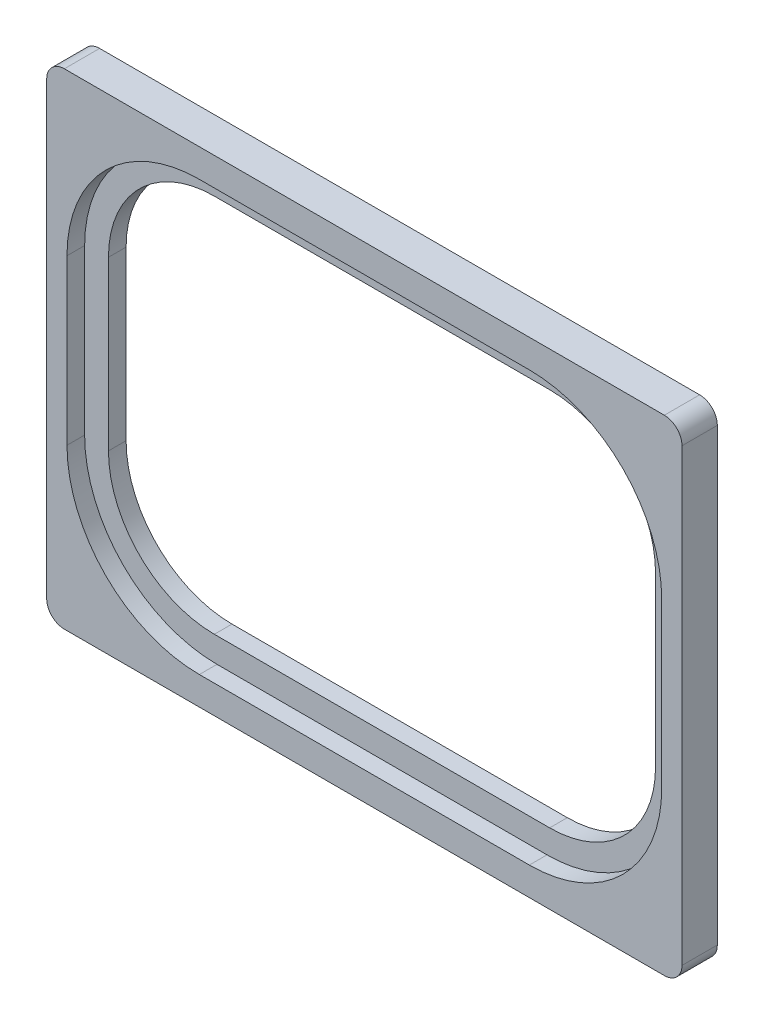
ISO-10303-21;
HEADER;
FILE_DESCRIPTION(('STEP AP214'),'2;1');
FILE_NAME('part.step','',(''),(''),'','','');
FILE_SCHEMA(('AUTOMOTIVE_DESIGN { 1 0 10303 214 1 1 1 1 }'));
ENDSEC;
DATA;
#1=APPLICATION_CONTEXT('core data for automotive mechanical design processes');
#2=APPLICATION_PROTOCOL_DEFINITION('international standard','automotive_design',2000,#1);
#3=PRODUCT_CONTEXT('',#1,'mechanical');
#4=PRODUCT('Part','Part','',(#3));
#5=PRODUCT_RELATED_PRODUCT_CATEGORY('part','',(#4));
#6=PRODUCT_DEFINITION_FORMATION('','',#4);
#7=PRODUCT_DEFINITION_CONTEXT('part definition',#1,'design');
#8=PRODUCT_DEFINITION('design','',#6,#7);
#9=PRODUCT_DEFINITION_SHAPE('','',#8);
#10=(LENGTH_UNIT() NAMED_UNIT(*) SI_UNIT(.MILLI.,.METRE.));
#11=(NAMED_UNIT(*) PLANE_ANGLE_UNIT() SI_UNIT($,.RADIAN.));
#12=(NAMED_UNIT(*) SI_UNIT($,.STERADIAN.) SOLID_ANGLE_UNIT());
#13=UNCERTAINTY_MEASURE_WITH_UNIT(LENGTH_MEASURE(1.E-05),#10,'distance_accuracy_value','');
#14=(GEOMETRIC_REPRESENTATION_CONTEXT(3) GLOBAL_UNCERTAINTY_ASSIGNED_CONTEXT((#13)) GLOBAL_UNIT_ASSIGNED_CONTEXT((#10,
#11,#12)) REPRESENTATION_CONTEXT('',''));
#15=CARTESIAN_POINT('',(0.,0.,0.));
#16=DIRECTION('',(0.,0.,1.));
#17=DIRECTION('',(1.,0.,0.));
#18=AXIS2_PLACEMENT_3D('',#15,#16,#17);
#19=CARTESIAN_POINT('',(19.,9.50000000000001,-0.00100000000000013));
#20=DIRECTION('',(0.,0.,1.));
#21=DIRECTION('',(1.,0.,0.));
#22=AXIS2_PLACEMENT_3D('',#19,#20,#21);
#23=CYLINDRICAL_SURFACE('',#22,12.);
#24=CARTESIAN_POINT('',(19.,9.50000000000001,2.));
#25=DIRECTION('',(0.,0.,1.));
#26=DIRECTION('',(1.,0.,0.));
#27=AXIS2_PLACEMENT_3D('',#24,#25,#26);
#28=CIRCLE('',#27,12.);
#29=CARTESIAN_POINT('',(18.9999999999999,21.5,2.));
#30=VERTEX_POINT('',#29);
#31=CARTESIAN_POINT('',(31.,9.49999999999992,2.));
#32=VERTEX_POINT('',#31);
#33=EDGE_CURVE('E279',#30,#32,#28,.F.);
#34=ORIENTED_EDGE('',*,*,#33,.F.);
#35=DIRECTION('',(0.,0.,1.));
#36=VECTOR('',#35,1.);
#37=CARTESIAN_POINT('',(18.9999999999999,21.5,-0.00100000000000013));
#38=LINE('',#37,#36);
#39=CARTESIAN_POINT('',(18.9999999999999,21.5,0.));
#40=VERTEX_POINT('',#39);
#41=EDGE_CURVE('E302',#40,#30,#38,.T.);
#42=ORIENTED_EDGE('',*,*,#41,.F.);
#43=CARTESIAN_POINT('',(19.,9.50000000000001,0.));
#44=DIRECTION('',(0.,0.,-1.));
#45=DIRECTION('',(-1.,0.,0.));
#46=AXIS2_PLACEMENT_3D('',#43,#44,#45);
#47=CIRCLE('',#46,12.);
#48=CARTESIAN_POINT('',(31.,9.49999999999992,0.));
#49=VERTEX_POINT('',#48);
#50=EDGE_CURVE('E299',#49,#40,#47,.F.);
#51=ORIENTED_EDGE('',*,*,#50,.F.);
#52=DIRECTION('',(0.,0.,1.));
#53=VECTOR('',#52,1.);
#54=CARTESIAN_POINT('',(31.,9.49999999999992,-0.00100000000000013));
#55=LINE('',#54,#53);
#56=EDGE_CURVE('E303',#49,#32,#55,.T.);
#57=ORIENTED_EDGE('',*,*,#56,.T.);
#58=EDGE_LOOP('',(#34,#42,#51,#57));
#59=FACE_BOUND('',#58,.T.);
#60=ADVANCED_FACE('F38',(#59),#23,.F.);
#61=CARTESIAN_POINT('',(31.,-9.4999999999999,-0.00100000000000013));
#62=DIRECTION('',(1.,0.,0.));
#63=DIRECTION('',(0.,1.,0.));
#64=AXIS2_PLACEMENT_3D('',#61,#62,#63);
#65=PLANE('',#64);
#66=DIRECTION('',(0.,-1.,0.));
#67=VECTOR('',#66,1.);
#68=CARTESIAN_POINT('',(31.,-9.4999999999999,2.));
#69=LINE('',#68,#67);
#70=CARTESIAN_POINT('',(31.,-9.49999999999999,2.));
#71=VERTEX_POINT('',#70);
#72=EDGE_CURVE('E277',#32,#71,#69,.T.);
#73=ORIENTED_EDGE('',*,*,#72,.F.);
#74=ORIENTED_EDGE('',*,*,#56,.F.);
#75=DIRECTION('',(0.,1.,0.));
#76=VECTOR('',#75,1.);
#77=CARTESIAN_POINT('',(31.,-9.4999999999999,0.));
#78=LINE('',#77,#76);
#79=CARTESIAN_POINT('',(31.,-9.4999999999999,0.));
#80=VERTEX_POINT('',#79);
#81=EDGE_CURVE('E296',#80,#49,#78,.T.);
#82=ORIENTED_EDGE('',*,*,#81,.F.);
#83=DIRECTION('',(0.,0.,1.));
#84=VECTOR('',#83,1.);
#85=CARTESIAN_POINT('',(31.,-9.4999999999999,-0.00100000000000013));
#86=LINE('',#85,#84);
#87=EDGE_CURVE('E307',#80,#71,#86,.T.);
#88=ORIENTED_EDGE('',*,*,#87,.T.);
#89=EDGE_LOOP('',(#73,#74,#82,#88));
#90=FACE_BOUND('',#89,.T.);
#91=ADVANCED_FACE('F432',(#90),#65,.F.);
#92=CARTESIAN_POINT('',(19.,-9.49999999999999,-0.00100000000000013));
#93=DIRECTION('',(0.,0.,1.));
#94=DIRECTION('',(1.,0.,0.));
#95=AXIS2_PLACEMENT_3D('',#92,#93,#94);
#96=CYLINDRICAL_SURFACE('',#95,12.);
#97=CARTESIAN_POINT('',(19.,-9.49999999999999,2.));
#98=DIRECTION('',(0.,0.,1.));
#99=DIRECTION('',(1.,0.,0.));
#100=AXIS2_PLACEMENT_3D('',#97,#98,#99);
#101=CIRCLE('',#100,12.);
#102=CARTESIAN_POINT('',(18.9999999999999,-21.5,2.));
#103=VERTEX_POINT('',#102);
#104=EDGE_CURVE('E275',#71,#103,#101,.F.);
#105=ORIENTED_EDGE('',*,*,#104,.F.);
#106=ORIENTED_EDGE('',*,*,#87,.F.);
#107=CARTESIAN_POINT('',(19.,-9.49999999999999,0.));
#108=DIRECTION('',(0.,0.,-1.));
#109=DIRECTION('',(-1.,0.,0.));
#110=AXIS2_PLACEMENT_3D('',#107,#108,#109);
#111=CIRCLE('',#110,12.);
#112=CARTESIAN_POINT('',(18.9999999999999,-21.5,0.));
#113=VERTEX_POINT('',#112);
#114=EDGE_CURVE('E293',#113,#80,#111,.F.);
#115=ORIENTED_EDGE('',*,*,#114,.F.);
#116=DIRECTION('',(0.,0.,1.));
#117=VECTOR('',#116,1.);
#118=CARTESIAN_POINT('',(18.9999999999999,-21.5,-0.00100000000000013));
#119=LINE('',#118,#117);
#120=EDGE_CURVE('E310',#113,#103,#119,.T.);
#121=ORIENTED_EDGE('',*,*,#120,.T.);
#122=EDGE_LOOP('',(#105,#106,#115,#121));
#123=FACE_BOUND('',#122,.T.);
#124=ADVANCED_FACE('F438',(#123),#96,.F.);
#125=CARTESIAN_POINT('',(-18.9999999999999,-21.5,-0.00100000000000013));
#126=DIRECTION('',(0.,-1.,0.));
#127=DIRECTION('',(1.,0.,0.));
#128=AXIS2_PLACEMENT_3D('',#125,#126,#127);
#129=PLANE('',#128);
#130=DIRECTION('',(-1.,0.,0.));
#131=VECTOR('',#130,1.);
#132=CARTESIAN_POINT('',(-18.9999999999999,-21.5,2.));
#133=LINE('',#132,#131);
#134=CARTESIAN_POINT('',(-18.9999999999999,-21.5,2.));
#135=VERTEX_POINT('',#134);
#136=EDGE_CURVE('E273',#103,#135,#133,.T.);
#137=ORIENTED_EDGE('',*,*,#136,.F.);
#138=ORIENTED_EDGE('',*,*,#120,.F.);
#139=DIRECTION('',(1.,0.,0.));
#140=VECTOR('',#139,1.);
#141=CARTESIAN_POINT('',(-18.9999999999999,-21.5,0.));
#142=LINE('',#141,#140);
#143=CARTESIAN_POINT('',(-18.9999999999999,-21.5,0.));
#144=VERTEX_POINT('',#143);
#145=EDGE_CURVE('E290',#144,#113,#142,.T.);
#146=ORIENTED_EDGE('',*,*,#145,.F.);
#147=DIRECTION('',(0.,0.,1.));
#148=VECTOR('',#147,1.);
#149=CARTESIAN_POINT('',(-18.9999999999999,-21.5,-0.00100000000000013));
#150=LINE('',#149,#148);
#151=EDGE_CURVE('E313',#144,#135,#150,.T.);
#152=ORIENTED_EDGE('',*,*,#151,.T.);
#153=EDGE_LOOP('',(#137,#138,#146,#152));
#154=FACE_BOUND('',#153,.T.);
#155=ADVANCED_FACE('F511',(#154),#129,.F.);
#156=CARTESIAN_POINT('',(-19.,-9.49999999999999,-0.00100000000000013));
#157=DIRECTION('',(0.,0.,1.));
#158=DIRECTION('',(1.,0.,0.));
#159=AXIS2_PLACEMENT_3D('',#156,#157,#158);
#160=CYLINDRICAL_SURFACE('',#159,12.);
#161=CARTESIAN_POINT('',(-19.,-9.49999999999999,2.));
#162=DIRECTION('',(0.,0.,1.));
#163=DIRECTION('',(1.,0.,0.));
#164=AXIS2_PLACEMENT_3D('',#161,#162,#163);
#165=CIRCLE('',#164,12.);
#166=CARTESIAN_POINT('',(-31.,-9.4999999999999,2.));
#167=VERTEX_POINT('',#166);
#168=EDGE_CURVE('E271',#135,#167,#165,.F.);
#169=ORIENTED_EDGE('',*,*,#168,.F.);
#170=ORIENTED_EDGE('',*,*,#151,.F.);
#171=CARTESIAN_POINT('',(-19.,-9.49999999999999,0.));
#172=DIRECTION('',(0.,0.,-1.));
#173=DIRECTION('',(-1.,0.,0.));
#174=AXIS2_PLACEMENT_3D('',#171,#172,#173);
#175=CIRCLE('',#174,12.);
#176=CARTESIAN_POINT('',(-31.,-9.4999999999999,0.));
#177=VERTEX_POINT('',#176);
#178=EDGE_CURVE('E287',#177,#144,#175,.F.);
#179=ORIENTED_EDGE('',*,*,#178,.F.);
#180=DIRECTION('',(0.,0.,1.));
#181=VECTOR('',#180,1.);
#182=CARTESIAN_POINT('',(-31.,-9.49999999999991,-0.00100000000000013));
#183=LINE('',#182,#181);
#184=EDGE_CURVE('E316',#177,#167,#183,.T.);
#185=ORIENTED_EDGE('',*,*,#184,.T.);
#186=EDGE_LOOP('',(#169,#170,#179,#185));
#187=FACE_BOUND('',#186,.T.);
#188=ADVANCED_FACE('F521',(#187),#160,.F.);
#189=CARTESIAN_POINT('',(-31.,9.49999999999992,-0.00100000000000013));
#190=DIRECTION('',(-1.,0.,0.));
#191=DIRECTION('',(0.,-1.,0.));
#192=AXIS2_PLACEMENT_3D('',#189,#190,#191);
#193=PLANE('',#192);
#194=DIRECTION('',(0.,1.,0.));
#195=VECTOR('',#194,1.);
#196=CARTESIAN_POINT('',(-31.,9.49999999999992,2.));
#197=LINE('',#196,#195);
#198=CARTESIAN_POINT('',(-31.,9.49999999999992,2.));
#199=VERTEX_POINT('',#198);
#200=EDGE_CURVE('E269',#167,#199,#197,.T.);
#201=ORIENTED_EDGE('',*,*,#200,.F.);
#202=ORIENTED_EDGE('',*,*,#184,.F.);
#203=DIRECTION('',(0.,-1.,0.));
#204=VECTOR('',#203,1.);
#205=CARTESIAN_POINT('',(-31.,9.49999999999992,0.));
#206=LINE('',#205,#204);
#207=CARTESIAN_POINT('',(-31.,9.50000000000001,0.));
#208=VERTEX_POINT('',#207);
#209=EDGE_CURVE('E284',#208,#177,#206,.T.);
#210=ORIENTED_EDGE('',*,*,#209,.F.);
#211=DIRECTION('',(0.,0.,1.));
#212=VECTOR('',#211,1.);
#213=CARTESIAN_POINT('',(-31.,9.49999999999992,-0.00100000000000013));
#214=LINE('',#213,#212);
#215=EDGE_CURVE('E319',#208,#199,#214,.T.);
#216=ORIENTED_EDGE('',*,*,#215,.T.);
#217=EDGE_LOOP('',(#201,#202,#210,#216));
#218=FACE_BOUND('',#217,.T.);
#219=ADVANCED_FACE('F531',(#218),#193,.F.);
#220=CARTESIAN_POINT('',(-19.,9.50000000000001,-0.00100000000000013));
#221=DIRECTION('',(0.,0.,1.));
#222=DIRECTION('',(1.,0.,0.));
#223=AXIS2_PLACEMENT_3D('',#220,#221,#222);
#224=CYLINDRICAL_SURFACE('',#223,12.);
#225=CARTESIAN_POINT('',(-19.,9.50000000000001,2.));
#226=DIRECTION('',(0.,0.,1.));
#227=DIRECTION('',(1.,0.,0.));
#228=AXIS2_PLACEMENT_3D('',#225,#226,#227);
#229=CIRCLE('',#228,12.);
#230=CARTESIAN_POINT('',(-18.9999999999999,21.5,2.));
#231=VERTEX_POINT('',#230);
#232=EDGE_CURVE('E60',#199,#231,#229,.F.);
#233=ORIENTED_EDGE('',*,*,#232,.F.);
#234=ORIENTED_EDGE('',*,*,#215,.F.);
#235=CARTESIAN_POINT('',(-19.,9.50000000000001,0.));
#236=DIRECTION('',(0.,0.,-1.));
#237=DIRECTION('',(-1.,0.,0.));
#238=AXIS2_PLACEMENT_3D('',#235,#236,#237);
#239=CIRCLE('',#238,12.);
#240=CARTESIAN_POINT('',(-18.9999999999999,21.5,0.));
#241=VERTEX_POINT('',#240);
#242=EDGE_CURVE('E281',#241,#208,#239,.F.);
#243=ORIENTED_EDGE('',*,*,#242,.F.);
#244=DIRECTION('',(0.,0.,1.));
#245=VECTOR('',#244,1.);
#246=CARTESIAN_POINT('',(-18.9999999999999,21.5,-0.00100000000000013));
#247=LINE('',#246,#245);
#248=EDGE_CURVE('E322',#241,#231,#247,.T.);
#249=ORIENTED_EDGE('',*,*,#248,.T.);
#250=EDGE_LOOP('',(#233,#234,#243,#249));
#251=FACE_BOUND('',#250,.T.);
#252=ADVANCED_FACE('F541',(#251),#224,.F.);
#253=CARTESIAN_POINT('',(18.9999999999999,21.5,-0.00100000000000013));
#254=DIRECTION('',(0.,1.,0.));
#255=DIRECTION('',(-1.,0.,0.));
#256=AXIS2_PLACEMENT_3D('',#253,#254,#255);
#257=PLANE('',#256);
#258=DIRECTION('',(1.,0.,0.));
#259=VECTOR('',#258,1.);
#260=CARTESIAN_POINT('',(18.9999999999999,21.5,2.));
#261=LINE('',#260,#259);
#262=EDGE_CURVE('E11',#231,#30,#261,.T.);
#263=ORIENTED_EDGE('',*,*,#262,.F.);
#264=ORIENTED_EDGE('',*,*,#248,.F.);
#265=DIRECTION('',(-1.,0.,0.));
#266=VECTOR('',#265,1.);
#267=CARTESIAN_POINT('',(18.9999999999999,21.5,0.));
#268=LINE('',#267,#266);
#269=EDGE_CURVE('E306',#40,#241,#268,.T.);
#270=ORIENTED_EDGE('',*,*,#269,.F.);
#271=ORIENTED_EDGE('',*,*,#41,.T.);
#272=EDGE_LOOP('',(#263,#264,#270,#271));
#273=FACE_BOUND('',#272,.T.);
#274=ADVANCED_FACE('F444',(#273),#257,.F.);
#275=CARTESIAN_POINT('',(-36.,27.5,4.));
#276=DIRECTION('',(1.,0.,0.));
#277=DIRECTION('',(0.,1.,0.));
#278=AXIS2_PLACEMENT_3D('',#275,#276,#277);
#279=PLANE('',#278);
#280=DIRECTION('',(0.,-1.,0.));
#281=VECTOR('',#280,1.);
#282=CARTESIAN_POINT('',(-36.,27.5,0.));
#283=LINE('',#282,#281);
#284=CARTESIAN_POINT('',(-36.,25.5,0.));
#285=VERTEX_POINT('',#284);
#286=CARTESIAN_POINT('',(-36.,-25.5,0.));
#287=VERTEX_POINT('',#286);
#288=EDGE_CURVE('E329',#285,#287,#283,.T.);
#289=ORIENTED_EDGE('',*,*,#288,.T.);
#290=DIRECTION('',(0.,0.,-1.));
#291=VECTOR('',#290,1.);
#292=CARTESIAN_POINT('',(-36.,-25.5,4.));
#293=LINE('',#292,#291);
#294=CARTESIAN_POINT('',(-36.,-25.5,4.));
#295=VERTEX_POINT('',#294);
#296=EDGE_CURVE('E369',#287,#295,#293,.F.);
#297=ORIENTED_EDGE('',*,*,#296,.T.);
#298=DIRECTION('',(0.,-1.,0.));
#299=VECTOR('',#298,1.);
#300=CARTESIAN_POINT('',(-36.,27.5,4.));
#301=LINE('',#300,#299);
#302=CARTESIAN_POINT('',(-36.,25.5,4.));
#303=VERTEX_POINT('',#302);
#304=EDGE_CURVE('E330',#303,#295,#301,.T.);
#305=ORIENTED_EDGE('',*,*,#304,.F.);
#306=DIRECTION('',(0.,0.,-1.));
#307=VECTOR('',#306,1.);
#308=CARTESIAN_POINT('',(-36.,25.5,4.));
#309=LINE('',#308,#307);
#310=EDGE_CURVE('E366',#303,#285,#309,.T.);
#311=ORIENTED_EDGE('',*,*,#310,.T.);
#312=EDGE_LOOP('',(#289,#297,#305,#311));
#313=FACE_BOUND('',#312,.T.);
#314=ADVANCED_FACE('F404',(#313),#279,.F.);
#315=CARTESIAN_POINT('',(36.,-27.5,4.));
#316=DIRECTION('',(0.,1.,0.));
#317=DIRECTION('',(-1.,0.,0.));
#318=AXIS2_PLACEMENT_3D('',#315,#316,#317);
#319=PLANE('',#318);
#320=DIRECTION('',(1.,0.,0.));
#321=VECTOR('',#320,1.);
#322=CARTESIAN_POINT('',(36.,-27.5,4.));
#323=LINE('',#322,#321);
#324=CARTESIAN_POINT('',(-34.,-27.5,4.));
#325=VERTEX_POINT('',#324);
#326=CARTESIAN_POINT('',(34.,-27.5,4.));
#327=VERTEX_POINT('',#326);
#328=EDGE_CURVE('E333',#325,#327,#323,.T.);
#329=ORIENTED_EDGE('',*,*,#328,.F.);
#330=DIRECTION('',(0.,0.,-1.));
#331=VECTOR('',#330,1.);
#332=CARTESIAN_POINT('',(-34.,-27.5,4.));
#333=LINE('',#332,#331);
#334=CARTESIAN_POINT('',(-34.,-27.5,0.));
#335=VERTEX_POINT('',#334);
#336=EDGE_CURVE('E355',#325,#335,#333,.T.);
#337=ORIENTED_EDGE('',*,*,#336,.T.);
#338=DIRECTION('',(1.,0.,0.));
#339=VECTOR('',#338,1.);
#340=CARTESIAN_POINT('',(36.,-27.5,0.));
#341=LINE('',#340,#339);
#342=CARTESIAN_POINT('',(34.,-27.5,0.));
#343=VERTEX_POINT('',#342);
#344=EDGE_CURVE('E346',#335,#343,#341,.T.);
#345=ORIENTED_EDGE('',*,*,#344,.T.);
#346=DIRECTION('',(0.,0.,-1.));
#347=VECTOR('',#346,1.);
#348=CARTESIAN_POINT('',(34.,-27.5,4.));
#349=LINE('',#348,#347);
#350=EDGE_CURVE('E343',#343,#327,#349,.F.);
#351=ORIENTED_EDGE('',*,*,#350,.T.);
#352=EDGE_LOOP('',(#329,#337,#345,#351));
#353=FACE_BOUND('',#352,.T.);
#354=ADVANCED_FACE('F414',(#353),#319,.F.);
#355=CARTESIAN_POINT('',(36.,27.5,4.));
#356=DIRECTION('',(-1.,0.,0.));
#357=DIRECTION('',(0.,-1.,0.));
#358=AXIS2_PLACEMENT_3D('',#355,#356,#357);
#359=PLANE('',#358);
#360=DIRECTION('',(0.,1.,0.));
#361=VECTOR('',#360,1.);
#362=CARTESIAN_POINT('',(36.,27.5,4.));
#363=LINE('',#362,#361);
#364=CARTESIAN_POINT('',(36.,-25.5,4.));
#365=VERTEX_POINT('',#364);
#366=CARTESIAN_POINT('',(36.,25.5,4.));
#367=VERTEX_POINT('',#366);
#368=EDGE_CURVE('E337',#365,#367,#363,.T.);
#369=ORIENTED_EDGE('',*,*,#368,.F.);
#370=DIRECTION('',(0.,0.,-1.));
#371=VECTOR('',#370,1.);
#372=CARTESIAN_POINT('',(36.,-25.5,4.));
#373=LINE('',#372,#371);
#374=CARTESIAN_POINT('',(36.,-25.5,0.));
#375=VERTEX_POINT('',#374);
#376=EDGE_CURVE('E381',#365,#375,#373,.T.);
#377=ORIENTED_EDGE('',*,*,#376,.T.);
#378=DIRECTION('',(0.,1.,0.));
#379=VECTOR('',#378,1.);
#380=CARTESIAN_POINT('',(36.,27.5,0.));
#381=LINE('',#380,#379);
#382=CARTESIAN_POINT('',(36.,25.5,0.));
#383=VERTEX_POINT('',#382);
#384=EDGE_CURVE('E349',#375,#383,#381,.T.);
#385=ORIENTED_EDGE('',*,*,#384,.T.);
#386=DIRECTION('',(0.,0.,-1.));
#387=VECTOR('',#386,1.);
#388=CARTESIAN_POINT('',(36.,25.5,4.));
#389=LINE('',#388,#387);
#390=EDGE_CURVE('E379',#383,#367,#389,.F.);
#391=ORIENTED_EDGE('',*,*,#390,.T.);
#392=EDGE_LOOP('',(#369,#377,#385,#391));
#393=FACE_BOUND('',#392,.T.);
#394=ADVANCED_FACE('F422',(#393),#359,.F.);
#395=CARTESIAN_POINT('',(36.,27.5,4.));
#396=DIRECTION('',(0.,-1.,0.));
#397=DIRECTION('',(1.,0.,0.));
#398=AXIS2_PLACEMENT_3D('',#395,#396,#397);
#399=PLANE('',#398);
#400=DIRECTION('',(-1.,0.,0.));
#401=VECTOR('',#400,1.);
#402=CARTESIAN_POINT('',(36.,27.5,4.));
#403=LINE('',#402,#401);
#404=CARTESIAN_POINT('',(34.,27.5,4.));
#405=VERTEX_POINT('',#404);
#406=CARTESIAN_POINT('',(-34.,27.5,4.));
#407=VERTEX_POINT('',#406);
#408=EDGE_CURVE('E340',#405,#407,#403,.T.);
#409=ORIENTED_EDGE('',*,*,#408,.F.);
#410=DIRECTION('',(0.,0.,-1.));
#411=VECTOR('',#410,1.);
#412=CARTESIAN_POINT('',(34.,27.5,4.));
#413=LINE('',#412,#411);
#414=CARTESIAN_POINT('',(34.,27.5,0.));
#415=VERTEX_POINT('',#414);
#416=EDGE_CURVE('E46',#405,#415,#413,.T.);
#417=ORIENTED_EDGE('',*,*,#416,.T.);
#418=DIRECTION('',(-1.,0.,0.));
#419=VECTOR('',#418,1.);
#420=CARTESIAN_POINT('',(36.,27.5,0.));
#421=LINE('',#420,#419);
#422=CARTESIAN_POINT('',(-34.,27.5,0.));
#423=VERTEX_POINT('',#422);
#424=EDGE_CURVE('E334',#415,#423,#421,.T.);
#425=ORIENTED_EDGE('',*,*,#424,.T.);
#426=DIRECTION('',(0.,0.,-1.));
#427=VECTOR('',#426,1.);
#428=CARTESIAN_POINT('',(-34.,27.5,4.));
#429=LINE('',#428,#427);
#430=EDGE_CURVE('E384',#423,#407,#429,.F.);
#431=ORIENTED_EDGE('',*,*,#430,.T.);
#432=EDGE_LOOP('',(#409,#417,#425,#431));
#433=FACE_BOUND('',#432,.T.);
#434=ADVANCED_FACE('F390',(#433),#399,.F.);
#435=CARTESIAN_POINT('',(0.,0.,4.));
#436=DIRECTION('',(0.,0.,-1.));
#437=DIRECTION('',(-1.,0.,0.));
#438=AXIS2_PLACEMENT_3D('',#435,#436,#437);
#439=PLANE('',#438);
#440=DIRECTION('',(-1.,0.,0.));
#441=VECTOR('',#440,1.);
#442=CARTESIAN_POINT('',(18.7,24.3,4.));
#443=LINE('',#442,#441);
#444=CARTESIAN_POINT('',(18.7,24.3,4.));
#445=VERTEX_POINT('',#444);
#446=CARTESIAN_POINT('',(-18.7,24.3,4.));
#447=VERTEX_POINT('',#446);
#448=EDGE_CURVE('E239',#445,#447,#443,.T.);
#449=ORIENTED_EDGE('',*,*,#448,.F.);
#450=CARTESIAN_POINT('',(18.7,9.30000000000001,4.));
#451=DIRECTION('',(0.,0.,1.));
#452=DIRECTION('',(1.,0.,0.));
#453=AXIS2_PLACEMENT_3D('',#450,#451,#452);
#454=CIRCLE('',#453,15.);
#455=CARTESIAN_POINT('',(33.7,9.30000000000001,4.));
#456=VERTEX_POINT('',#455);
#457=EDGE_CURVE('E53',#456,#445,#454,.T.);
#458=ORIENTED_EDGE('',*,*,#457,.F.);
#459=DIRECTION('',(0.,1.,0.));
#460=VECTOR('',#459,1.);
#461=CARTESIAN_POINT('',(33.7,9.30000000000001,4.));
#462=LINE('',#461,#460);
#463=CARTESIAN_POINT('',(33.7,-9.3,4.));
#464=VERTEX_POINT('',#463);
#465=EDGE_CURVE('E219',#464,#456,#462,.T.);
#466=ORIENTED_EDGE('',*,*,#465,.F.);
#467=CARTESIAN_POINT('',(18.7,-9.3,4.));
#468=DIRECTION('',(0.,0.,1.));
#469=DIRECTION('',(-1.,0.,0.));
#470=AXIS2_PLACEMENT_3D('',#467,#468,#469);
#471=CIRCLE('',#470,15.);
#472=CARTESIAN_POINT('',(18.7,-24.3,4.));
#473=VERTEX_POINT('',#472);
#474=EDGE_CURVE('E222',#473,#464,#471,.T.);
#475=ORIENTED_EDGE('',*,*,#474,.F.);
#476=DIRECTION('',(1.,0.,0.));
#477=VECTOR('',#476,1.);
#478=CARTESIAN_POINT('',(18.7,-24.3,4.));
#479=LINE('',#478,#477);
#480=CARTESIAN_POINT('',(-18.7,-24.3,4.));
#481=VERTEX_POINT('',#480);
#482=EDGE_CURVE('E250',#481,#473,#479,.T.);
#483=ORIENTED_EDGE('',*,*,#482,.F.);
#484=CARTESIAN_POINT('',(-18.7,-9.3,4.));
#485=DIRECTION('',(0.,0.,1.));
#486=DIRECTION('',(1.,0.,0.));
#487=AXIS2_PLACEMENT_3D('',#484,#485,#486);
#488=CIRCLE('',#487,15.);
#489=CARTESIAN_POINT('',(-33.7,-9.3,4.));
#490=VERTEX_POINT('',#489);
#491=EDGE_CURVE('E247',#490,#481,#488,.T.);
#492=ORIENTED_EDGE('',*,*,#491,.F.);
#493=DIRECTION('',(0.,-1.,0.));
#494=VECTOR('',#493,1.);
#495=CARTESIAN_POINT('',(-33.7,9.3,4.));
#496=LINE('',#495,#494);
#497=CARTESIAN_POINT('',(-33.7,9.3,4.));
#498=VERTEX_POINT('',#497);
#499=EDGE_CURVE('E244',#498,#490,#496,.T.);
#500=ORIENTED_EDGE('',*,*,#499,.F.);
#501=CARTESIAN_POINT('',(-18.7,9.3,4.));
#502=DIRECTION('',(0.,0.,1.));
#503=DIRECTION('',(-1.,0.,0.));
#504=AXIS2_PLACEMENT_3D('',#501,#502,#503);
#505=CIRCLE('',#504,15.);
#506=EDGE_CURVE('E241',#447,#498,#505,.T.);
#507=ORIENTED_EDGE('',*,*,#506,.F.);
#508=EDGE_LOOP('',(#449,#458,#466,#475,#483,#492,#500,#507));
#509=FACE_BOUND('',#508,.T.);
#510=ORIENTED_EDGE('',*,*,#304,.T.);
#511=CARTESIAN_POINT('',(-34.,-25.5,4.));
#512=DIRECTION('',(0.,0.,-1.));
#513=DIRECTION('',(-1.,0.,0.));
#514=AXIS2_PLACEMENT_3D('',#511,#512,#513);
#515=CIRCLE('',#514,2.);
#516=EDGE_CURVE('E377',#295,#325,#515,.F.);
#517=ORIENTED_EDGE('',*,*,#516,.T.);
#518=ORIENTED_EDGE('',*,*,#328,.T.);
#519=CARTESIAN_POINT('',(34.,-25.5,4.));
#520=DIRECTION('',(0.,0.,-1.));
#521=DIRECTION('',(-1.,0.,0.));
#522=AXIS2_PLACEMENT_3D('',#519,#520,#521);
#523=CIRCLE('',#522,2.);
#524=EDGE_CURVE('E375',#327,#365,#523,.F.);
#525=ORIENTED_EDGE('',*,*,#524,.T.);
#526=ORIENTED_EDGE('',*,*,#368,.T.);
#527=CARTESIAN_POINT('',(34.,25.5,4.));
#528=DIRECTION('',(0.,0.,-1.));
#529=DIRECTION('',(-1.,0.,0.));
#530=AXIS2_PLACEMENT_3D('',#527,#528,#529);
#531=CIRCLE('',#530,2.);
#532=EDGE_CURVE('E373',#367,#405,#531,.F.);
#533=ORIENTED_EDGE('',*,*,#532,.T.);
#534=ORIENTED_EDGE('',*,*,#408,.T.);
#535=CARTESIAN_POINT('',(-34.,25.5,4.));
#536=DIRECTION('',(0.,0.,-1.));
#537=DIRECTION('',(-1.,0.,0.));
#538=AXIS2_PLACEMENT_3D('',#535,#536,#537);
#539=CIRCLE('',#538,2.);
#540=EDGE_CURVE('E371',#407,#303,#539,.F.);
#541=ORIENTED_EDGE('',*,*,#540,.T.);
#542=EDGE_LOOP('',(#510,#517,#518,#525,#526,#533,#534,#541));
#543=FACE_BOUND('',#542,.T.);
#544=ADVANCED_FACE('F408',(#509,#543),#439,.F.);
#545=CARTESIAN_POINT('',(0.,0.,0.));
#546=DIRECTION('',(0.,0.,-1.));
#547=DIRECTION('',(-1.,0.,0.));
#548=AXIS2_PLACEMENT_3D('',#545,#546,#547);
#549=PLANE('',#548);
#550=ORIENTED_EDGE('',*,*,#50,.T.);
#551=ORIENTED_EDGE('',*,*,#269,.T.);
#552=ORIENTED_EDGE('',*,*,#242,.T.);
#553=ORIENTED_EDGE('',*,*,#209,.T.);
#554=ORIENTED_EDGE('',*,*,#178,.T.);
#555=ORIENTED_EDGE('',*,*,#145,.T.);
#556=ORIENTED_EDGE('',*,*,#114,.T.);
#557=ORIENTED_EDGE('',*,*,#81,.T.);
#558=EDGE_LOOP('',(#550,#551,#552,#553,#554,#555,#556,#557));
#559=FACE_BOUND('',#558,.T.);
#560=ORIENTED_EDGE('',*,*,#344,.F.);
#561=CARTESIAN_POINT('',(-34.,-25.5,0.));
#562=DIRECTION('',(0.,0.,-1.));
#563=DIRECTION('',(-1.,0.,0.));
#564=AXIS2_PLACEMENT_3D('',#561,#562,#563);
#565=CIRCLE('',#564,2.);
#566=EDGE_CURVE('E364',#335,#287,#565,.T.);
#567=ORIENTED_EDGE('',*,*,#566,.T.);
#568=ORIENTED_EDGE('',*,*,#288,.F.);
#569=CARTESIAN_POINT('',(-34.,25.5,0.));
#570=DIRECTION('',(0.,0.,-1.));
#571=DIRECTION('',(-1.,0.,0.));
#572=AXIS2_PLACEMENT_3D('',#569,#570,#571);
#573=CIRCLE('',#572,2.);
#574=EDGE_CURVE('E358',#285,#423,#573,.T.);
#575=ORIENTED_EDGE('',*,*,#574,.T.);
#576=ORIENTED_EDGE('',*,*,#424,.F.);
#577=CARTESIAN_POINT('',(34.,25.5,0.));
#578=DIRECTION('',(0.,0.,-1.));
#579=DIRECTION('',(-1.,0.,0.));
#580=AXIS2_PLACEMENT_3D('',#577,#578,#579);
#581=CIRCLE('',#580,2.);
#582=EDGE_CURVE('E360',#415,#383,#581,.T.);
#583=ORIENTED_EDGE('',*,*,#582,.T.);
#584=ORIENTED_EDGE('',*,*,#384,.F.);
#585=CARTESIAN_POINT('',(34.,-25.5,0.));
#586=DIRECTION('',(0.,0.,-1.));
#587=DIRECTION('',(-1.,0.,0.));
#588=AXIS2_PLACEMENT_3D('',#585,#586,#587);
#589=CIRCLE('',#588,2.);
#590=EDGE_CURVE('E362',#375,#343,#589,.T.);
#591=ORIENTED_EDGE('',*,*,#590,.T.);
#592=EDGE_LOOP('',(#560,#567,#568,#575,#576,#583,#584,#591));
#593=FACE_BOUND('',#592,.T.);
#594=ADVANCED_FACE('F396',(#559,#593),#549,.T.);
#595=CARTESIAN_POINT('',(-34.,-25.5,4.));
#596=DIRECTION('',(0.,0.,-1.));
#597=DIRECTION('',(-1.,0.,0.));
#598=AXIS2_PLACEMENT_3D('',#595,#596,#597);
#599=CYLINDRICAL_SURFACE('',#598,2.);
#600=ORIENTED_EDGE('',*,*,#516,.F.);
#601=ORIENTED_EDGE('',*,*,#296,.F.);
#602=ORIENTED_EDGE('',*,*,#566,.F.);
#603=ORIENTED_EDGE('',*,*,#336,.F.);
#604=EDGE_LOOP('',(#600,#601,#602,#603));
#605=FACE_BOUND('',#604,.T.);
#606=ADVANCED_FACE('F412',(#605),#599,.T.);
#607=CARTESIAN_POINT('',(34.,-25.5,4.));
#608=DIRECTION('',(0.,0.,-1.));
#609=DIRECTION('',(-1.,0.,0.));
#610=AXIS2_PLACEMENT_3D('',#607,#608,#609);
#611=CYLINDRICAL_SURFACE('',#610,2.);
#612=ORIENTED_EDGE('',*,*,#524,.F.);
#613=ORIENTED_EDGE('',*,*,#350,.F.);
#614=ORIENTED_EDGE('',*,*,#590,.F.);
#615=ORIENTED_EDGE('',*,*,#376,.F.);
#616=EDGE_LOOP('',(#612,#613,#614,#615));
#617=FACE_BOUND('',#616,.T.);
#618=ADVANCED_FACE('F419',(#617),#611,.T.);
#619=CARTESIAN_POINT('',(34.,25.5,4.));
#620=DIRECTION('',(0.,0.,-1.));
#621=DIRECTION('',(-1.,0.,0.));
#622=AXIS2_PLACEMENT_3D('',#619,#620,#621);
#623=CYLINDRICAL_SURFACE('',#622,2.);
#624=ORIENTED_EDGE('',*,*,#532,.F.);
#625=ORIENTED_EDGE('',*,*,#390,.F.);
#626=ORIENTED_EDGE('',*,*,#582,.F.);
#627=ORIENTED_EDGE('',*,*,#416,.F.);
#628=EDGE_LOOP('',(#624,#625,#626,#627));
#629=FACE_BOUND('',#628,.T.);
#630=ADVANCED_FACE('F424',(#629),#623,.T.);
#631=CARTESIAN_POINT('',(-34.,25.5,4.));
#632=DIRECTION('',(0.,0.,-1.));
#633=DIRECTION('',(-1.,0.,0.));
#634=AXIS2_PLACEMENT_3D('',#631,#632,#633);
#635=CYLINDRICAL_SURFACE('',#634,2.);
#636=ORIENTED_EDGE('',*,*,#540,.F.);
#637=ORIENTED_EDGE('',*,*,#430,.F.);
#638=ORIENTED_EDGE('',*,*,#574,.F.);
#639=ORIENTED_EDGE('',*,*,#310,.F.);
#640=EDGE_LOOP('',(#636,#637,#638,#639));
#641=FACE_BOUND('',#640,.T.);
#642=ADVANCED_FACE('F40',(#641),#635,.T.);
#643=CARTESIAN_POINT('',(18.7,9.30000000000001,2.));
#644=DIRECTION('',(0.,0.,1.));
#645=DIRECTION('',(1.,0.,0.));
#646=AXIS2_PLACEMENT_3D('',#643,#644,#645);
#647=PLANE('',#646);
#648=CARTESIAN_POINT('',(18.7,9.30000000000001,2.));
#649=DIRECTION('',(0.,0.,1.));
#650=DIRECTION('',(1.,0.,0.));
#651=AXIS2_PLACEMENT_3D('',#648,#649,#650);
#652=CIRCLE('',#651,15.);
#653=CARTESIAN_POINT('',(33.7,9.30000000000001,2.));
#654=VERTEX_POINT('',#653);
#655=CARTESIAN_POINT('',(18.7,24.3,2.));
#656=VERTEX_POINT('',#655);
#657=EDGE_CURVE('E200',#654,#656,#652,.T.);
#658=ORIENTED_EDGE('',*,*,#657,.T.);
#659=DIRECTION('',(-1.,0.,0.));
#660=VECTOR('',#659,1.);
#661=CARTESIAN_POINT('',(18.7,24.3,2.));
#662=LINE('',#661,#660);
#663=CARTESIAN_POINT('',(-18.7,24.3,2.));
#664=VERTEX_POINT('',#663);
#665=EDGE_CURVE('E209',#656,#664,#662,.T.);
#666=ORIENTED_EDGE('',*,*,#665,.T.);
#667=CARTESIAN_POINT('',(-18.7,9.3,2.));
#668=DIRECTION('',(0.,0.,1.));
#669=DIRECTION('',(-1.,0.,0.));
#670=AXIS2_PLACEMENT_3D('',#667,#668,#669);
#671=CIRCLE('',#670,15.);
#672=CARTESIAN_POINT('',(-33.7,9.3,2.));
#673=VERTEX_POINT('',#672);
#674=EDGE_CURVE('E214',#664,#673,#671,.T.);
#675=ORIENTED_EDGE('',*,*,#674,.T.);
#676=DIRECTION('',(0.,-1.,0.));
#677=VECTOR('',#676,1.);
#678=CARTESIAN_POINT('',(-33.7,9.3,2.));
#679=LINE('',#678,#677);
#680=CARTESIAN_POINT('',(-33.7,-9.3,2.));
#681=VERTEX_POINT('',#680);
#682=EDGE_CURVE('E226',#673,#681,#679,.T.);
#683=ORIENTED_EDGE('',*,*,#682,.T.);
#684=CARTESIAN_POINT('',(-18.7,-9.3,2.));
#685=DIRECTION('',(0.,0.,1.));
#686=DIRECTION('',(1.,0.,0.));
#687=AXIS2_PLACEMENT_3D('',#684,#685,#686);
#688=CIRCLE('',#687,15.);
#689=CARTESIAN_POINT('',(-18.7,-24.3,2.));
#690=VERTEX_POINT('',#689);
#691=EDGE_CURVE('E229',#681,#690,#688,.T.);
#692=ORIENTED_EDGE('',*,*,#691,.T.);
#693=DIRECTION('',(1.,0.,0.));
#694=VECTOR('',#693,1.);
#695=CARTESIAN_POINT('',(18.7,-24.3,2.));
#696=LINE('',#695,#694);
#697=CARTESIAN_POINT('',(18.7,-24.3,2.));
#698=VERTEX_POINT('',#697);
#699=EDGE_CURVE('E232',#690,#698,#696,.T.);
#700=ORIENTED_EDGE('',*,*,#699,.T.);
#701=CARTESIAN_POINT('',(18.7,-9.3,2.));
#702=DIRECTION('',(0.,0.,1.));
#703=DIRECTION('',(-1.,0.,0.));
#704=AXIS2_PLACEMENT_3D('',#701,#702,#703);
#705=CIRCLE('',#704,15.);
#706=CARTESIAN_POINT('',(33.7,-9.3,2.));
#707=VERTEX_POINT('',#706);
#708=EDGE_CURVE('E235',#698,#707,#705,.T.);
#709=ORIENTED_EDGE('',*,*,#708,.T.);
#710=DIRECTION('',(0.,1.,0.));
#711=VECTOR('',#710,1.);
#712=CARTESIAN_POINT('',(33.7,9.30000000000001,2.));
#713=LINE('',#712,#711);
#714=EDGE_CURVE('E206',#707,#654,#713,.T.);
#715=ORIENTED_EDGE('',*,*,#714,.T.);
#716=EDGE_LOOP('',(#658,#666,#675,#683,#692,#700,#709,#715));
#717=FACE_BOUND('',#716,.T.);
#718=ORIENTED_EDGE('',*,*,#33,.T.);
#719=ORIENTED_EDGE('',*,*,#72,.T.);
#720=ORIENTED_EDGE('',*,*,#104,.T.);
#721=ORIENTED_EDGE('',*,*,#136,.T.);
#722=ORIENTED_EDGE('',*,*,#168,.T.);
#723=ORIENTED_EDGE('',*,*,#200,.T.);
#724=ORIENTED_EDGE('',*,*,#232,.T.);
#725=ORIENTED_EDGE('',*,*,#262,.T.);
#726=EDGE_LOOP('',(#718,#719,#720,#721,#722,#723,#724,#725));
#727=FACE_BOUND('',#726,.T.);
#728=ADVANCED_FACE('F216',(#717,#727),#647,.T.);
#729=CARTESIAN_POINT('',(18.7,9.30000000000001,2.));
#730=DIRECTION('',(0.,0.,1.));
#731=DIRECTION('',(1.,0.,0.));
#732=AXIS2_PLACEMENT_3D('',#729,#730,#731);
#733=CYLINDRICAL_SURFACE('',#732,15.);
#734=ORIENTED_EDGE('',*,*,#457,.T.);
#735=DIRECTION('',(0.,0.,1.));
#736=VECTOR('',#735,1.);
#737=CARTESIAN_POINT('',(18.7,24.3,2.));
#738=LINE('',#737,#736);
#739=EDGE_CURVE('E196',#656,#445,#738,.T.);
#740=ORIENTED_EDGE('',*,*,#739,.F.);
#741=ORIENTED_EDGE('',*,*,#657,.F.);
#742=DIRECTION('',(0.,0.,1.));
#743=VECTOR('',#742,1.);
#744=CARTESIAN_POINT('',(33.7,9.30000000000001,2.));
#745=LINE('',#744,#743);
#746=EDGE_CURVE('E255',#654,#456,#745,.T.);
#747=ORIENTED_EDGE('',*,*,#746,.T.);
#748=EDGE_LOOP('',(#734,#740,#741,#747));
#749=FACE_BOUND('',#748,.T.);
#750=ADVANCED_FACE('F198',(#749),#733,.F.);
#751=CARTESIAN_POINT('',(33.7,9.30000000000001,2.));
#752=DIRECTION('',(1.,0.,0.));
#753=DIRECTION('',(0.,1.,0.));
#754=AXIS2_PLACEMENT_3D('',#751,#752,#753);
#755=PLANE('',#754);
#756=ORIENTED_EDGE('',*,*,#465,.T.);
#757=ORIENTED_EDGE('',*,*,#746,.F.);
#758=ORIENTED_EDGE('',*,*,#714,.F.);
#759=DIRECTION('',(0.,0.,1.));
#760=VECTOR('',#759,1.);
#761=CARTESIAN_POINT('',(33.7,-9.3,2.));
#762=LINE('',#761,#760);
#763=EDGE_CURVE('E257',#707,#464,#762,.T.);
#764=ORIENTED_EDGE('',*,*,#763,.T.);
#765=EDGE_LOOP('',(#756,#757,#758,#764));
#766=FACE_BOUND('',#765,.T.);
#767=ADVANCED_FACE('F580',(#766),#755,.F.);
#768=CARTESIAN_POINT('',(18.7,-9.3,2.));
#769=DIRECTION('',(0.,0.,1.));
#770=DIRECTION('',(1.,0.,0.));
#771=AXIS2_PLACEMENT_3D('',#768,#769,#770);
#772=CYLINDRICAL_SURFACE('',#771,15.);
#773=ORIENTED_EDGE('',*,*,#474,.T.);
#774=ORIENTED_EDGE('',*,*,#763,.F.);
#775=ORIENTED_EDGE('',*,*,#708,.F.);
#776=DIRECTION('',(0.,0.,1.));
#777=VECTOR('',#776,1.);
#778=CARTESIAN_POINT('',(18.7,-24.3,2.));
#779=LINE('',#778,#777);
#780=EDGE_CURVE('E259',#698,#473,#779,.T.);
#781=ORIENTED_EDGE('',*,*,#780,.T.);
#782=EDGE_LOOP('',(#773,#774,#775,#781));
#783=FACE_BOUND('',#782,.T.);
#784=ADVANCED_FACE('F590',(#783),#772,.F.);
#785=CARTESIAN_POINT('',(18.7,-24.3,2.));
#786=DIRECTION('',(0.,-1.,0.));
#787=DIRECTION('',(1.,0.,0.));
#788=AXIS2_PLACEMENT_3D('',#785,#786,#787);
#789=PLANE('',#788);
#790=ORIENTED_EDGE('',*,*,#482,.T.);
#791=ORIENTED_EDGE('',*,*,#780,.F.);
#792=ORIENTED_EDGE('',*,*,#699,.F.);
#793=DIRECTION('',(0.,0.,1.));
#794=VECTOR('',#793,1.);
#795=CARTESIAN_POINT('',(-18.7,-24.3,2.));
#796=LINE('',#795,#794);
#797=EDGE_CURVE('E261',#690,#481,#796,.T.);
#798=ORIENTED_EDGE('',*,*,#797,.T.);
#799=EDGE_LOOP('',(#790,#791,#792,#798));
#800=FACE_BOUND('',#799,.T.);
#801=ADVANCED_FACE('F601',(#800),#789,.F.);
#802=CARTESIAN_POINT('',(-18.7,-9.3,2.));
#803=DIRECTION('',(0.,0.,1.));
#804=DIRECTION('',(1.,0.,0.));
#805=AXIS2_PLACEMENT_3D('',#802,#803,#804);
#806=CYLINDRICAL_SURFACE('',#805,15.);
#807=ORIENTED_EDGE('',*,*,#491,.T.);
#808=ORIENTED_EDGE('',*,*,#797,.F.);
#809=ORIENTED_EDGE('',*,*,#691,.F.);
#810=DIRECTION('',(0.,0.,1.));
#811=VECTOR('',#810,1.);
#812=CARTESIAN_POINT('',(-33.7,-9.3,2.));
#813=LINE('',#812,#811);
#814=EDGE_CURVE('E263',#681,#490,#813,.T.);
#815=ORIENTED_EDGE('',*,*,#814,.T.);
#816=EDGE_LOOP('',(#807,#808,#809,#815));
#817=FACE_BOUND('',#816,.T.);
#818=ADVANCED_FACE('F612',(#817),#806,.F.);
#819=CARTESIAN_POINT('',(-33.7,9.3,2.));
#820=DIRECTION('',(-1.,0.,0.));
#821=DIRECTION('',(0.,0.,1.));
#822=AXIS2_PLACEMENT_3D('',#819,#820,#821);
#823=PLANE('',#822);
#824=ORIENTED_EDGE('',*,*,#499,.T.);
#825=ORIENTED_EDGE('',*,*,#814,.F.);
#826=ORIENTED_EDGE('',*,*,#682,.F.);
#827=DIRECTION('',(0.,0.,1.));
#828=VECTOR('',#827,1.);
#829=CARTESIAN_POINT('',(-33.7,9.3,2.));
#830=LINE('',#829,#828);
#831=EDGE_CURVE('E265',#673,#498,#830,.T.);
#832=ORIENTED_EDGE('',*,*,#831,.T.);
#833=EDGE_LOOP('',(#824,#825,#826,#832));
#834=FACE_BOUND('',#833,.T.);
#835=ADVANCED_FACE('F623',(#834),#823,.F.);
#836=CARTESIAN_POINT('',(-18.7,9.3,2.));
#837=DIRECTION('',(0.,0.,1.));
#838=DIRECTION('',(1.,0.,0.));
#839=AXIS2_PLACEMENT_3D('',#836,#837,#838);
#840=CYLINDRICAL_SURFACE('',#839,15.);
#841=ORIENTED_EDGE('',*,*,#506,.T.);
#842=ORIENTED_EDGE('',*,*,#831,.F.);
#843=ORIENTED_EDGE('',*,*,#674,.F.);
#844=DIRECTION('',(0.,0.,1.));
#845=VECTOR('',#844,1.);
#846=CARTESIAN_POINT('',(-18.7,24.3,2.));
#847=LINE('',#846,#845);
#848=EDGE_CURVE('E205',#664,#447,#847,.T.);
#849=ORIENTED_EDGE('',*,*,#848,.T.);
#850=EDGE_LOOP('',(#841,#842,#843,#849));
#851=FACE_BOUND('',#850,.T.);
#852=ADVANCED_FACE('F634',(#851),#840,.F.);
#853=CARTESIAN_POINT('',(18.7,24.3,2.));
#854=DIRECTION('',(0.,1.,0.));
#855=DIRECTION('',(-1.,0.,0.));
#856=AXIS2_PLACEMENT_3D('',#853,#854,#855);
#857=PLANE('',#856);
#858=ORIENTED_EDGE('',*,*,#448,.T.);
#859=ORIENTED_EDGE('',*,*,#848,.F.);
#860=ORIENTED_EDGE('',*,*,#665,.F.);
#861=ORIENTED_EDGE('',*,*,#739,.T.);
#862=EDGE_LOOP('',(#858,#859,#860,#861));
#863=FACE_BOUND('',#862,.T.);
#864=ADVANCED_FACE('F210',(#863),#857,.F.);
#865=CLOSED_SHELL('',(#60,#91,#124,#155,#188,#219,#252,#274,#314,#354,#394,#434,#544,#594,#606,
#618,#630,#642,#728,#750,#767,#784,#801,#818,#835,#852,#864));
#866=MANIFOLD_SOLID_BREP('B2',#865);
#867=ADVANCED_BREP_SHAPE_REPRESENTATION('',(#18,#866),#14);
#868=SHAPE_DEFINITION_REPRESENTATION(#9,#867);
ENDSEC;
END-ISO-10303-21;
